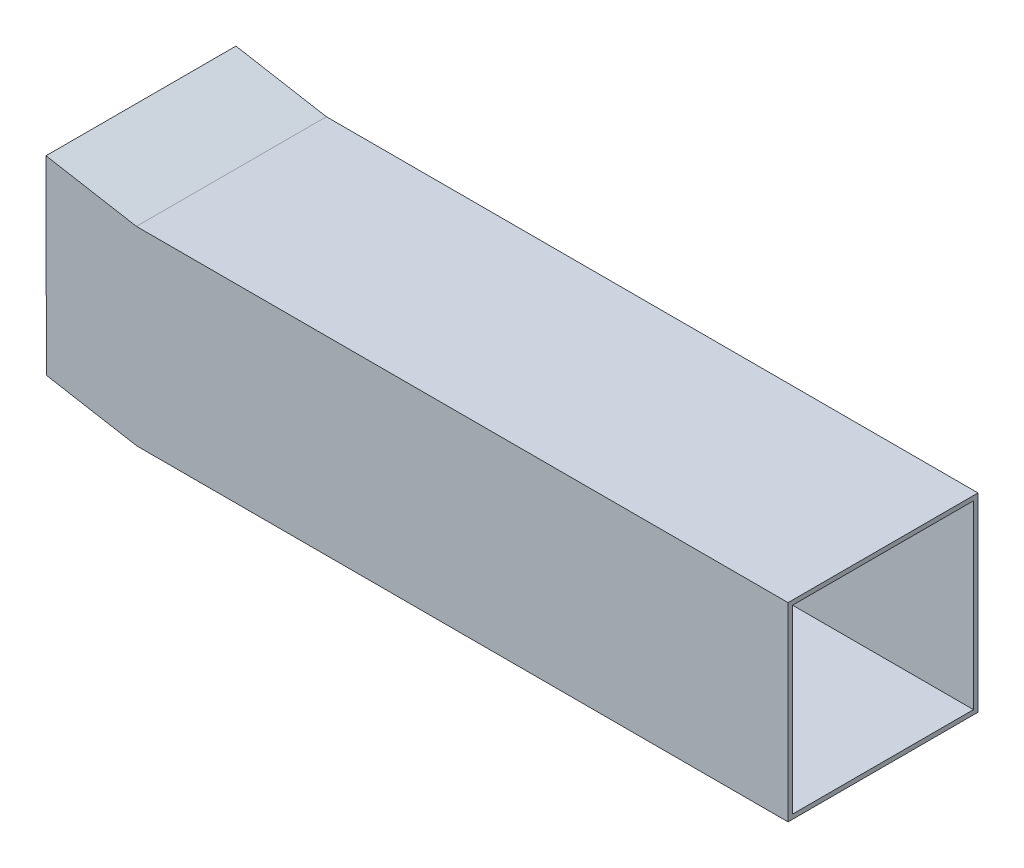
ISO-10303-21;
HEADER;
FILE_DESCRIPTION(('STEP AP214'),'2;1');
FILE_NAME('part.step','',(''),(''),'','','');
FILE_SCHEMA(('AUTOMOTIVE_DESIGN { 1 0 10303 214 1 1 1 1 }'));
ENDSEC;
DATA;
#1=APPLICATION_CONTEXT('core data for automotive mechanical design processes');
#2=APPLICATION_PROTOCOL_DEFINITION('international standard','automotive_design',2000,#1);
#3=PRODUCT_CONTEXT('',#1,'mechanical');
#4=PRODUCT('Part','Part','',(#3));
#5=PRODUCT_RELATED_PRODUCT_CATEGORY('part','',(#4));
#6=PRODUCT_DEFINITION_FORMATION('','',#4);
#7=PRODUCT_DEFINITION_CONTEXT('part definition',#1,'design');
#8=PRODUCT_DEFINITION('design','',#6,#7);
#9=PRODUCT_DEFINITION_SHAPE('','',#8);
#10=(LENGTH_UNIT() NAMED_UNIT(*) SI_UNIT(.MILLI.,.METRE.));
#11=(NAMED_UNIT(*) PLANE_ANGLE_UNIT() SI_UNIT($,.RADIAN.));
#12=(NAMED_UNIT(*) SI_UNIT($,.STERADIAN.) SOLID_ANGLE_UNIT());
#13=UNCERTAINTY_MEASURE_WITH_UNIT(LENGTH_MEASURE(1.E-05),#10,'distance_accuracy_value','');
#14=(GEOMETRIC_REPRESENTATION_CONTEXT(3) GLOBAL_UNCERTAINTY_ASSIGNED_CONTEXT((#13)) GLOBAL_UNIT_ASSIGNED_CONTEXT((#10,
#11,#12)) REPRESENTATION_CONTEXT('',''));
#15=CARTESIAN_POINT('',(0.,0.,0.));
#16=DIRECTION('',(0.,0.,1.));
#17=DIRECTION('',(1.,0.,0.));
#18=AXIS2_PLACEMENT_3D('',#15,#16,#17);
#19=CARTESIAN_POINT('',(-310.,1.63890065539904E-13,-126.));
#20=DIRECTION('',(-1.,0.,0.));
#21=DIRECTION('',(0.,-1.,0.));
#22=AXIS2_PLACEMENT_3D('',#19,#20,#21);
#23=PLANE('',#22);
#24=DIRECTION('',(0.,0.,1.));
#25=VECTOR('',#24,1.);
#26=CARTESIAN_POINT('',(-310.,-99.9228669405712,-126.));
#27=LINE('',#26,#25);
#28=CARTESIAN_POINT('',(-310.,-99.9228669405712,0.));
#29=VERTEX_POINT('',#28);
#30=CARTESIAN_POINT('',(-310.,-99.9228669405712,4.99999999999995));
#31=VERTEX_POINT('',#30);
#32=EDGE_CURVE('E377',#29,#31,#27,.T.);
#33=ORIENTED_EDGE('',*,*,#32,.T.);
#34=DIRECTION('',(0.,1.,0.));
#35=VECTOR('',#34,1.);
#36=CARTESIAN_POINT('',(-310.,1.63890065539904E-13,5.));
#37=LINE('',#36,#35);
#38=CARTESIAN_POINT('',(-310.,99.8220969025852,5.));
#39=VERTEX_POINT('',#38);
#40=EDGE_CURVE('E230',#31,#39,#37,.T.);
#41=ORIENTED_EDGE('',*,*,#40,.T.);
#42=DIRECTION('',(0.,0.,1.));
#43=VECTOR('',#42,1.);
#44=CARTESIAN_POINT('',(-310.,99.8220969025852,-126.));
#45=LINE('',#44,#43);
#46=CARTESIAN_POINT('',(-310.,99.8220969025852,0.));
#47=VERTEX_POINT('',#46);
#48=EDGE_CURVE('E372',#47,#39,#45,.T.);
#49=ORIENTED_EDGE('',*,*,#48,.F.);
#50=DIRECTION('',(0.,1.,0.));
#51=VECTOR('',#50,1.);
#52=CARTESIAN_POINT('',(-310.,1.63890065539904E-13,0.));
#53=LINE('',#52,#51);
#54=EDGE_CURVE('E404',#29,#47,#53,.T.);
#55=ORIENTED_EDGE('',*,*,#54,.F.);
#56=EDGE_LOOP('',(#33,#41,#49,#55));
#57=FACE_BOUND('',#56,.T.);
#58=ADVANCED_FACE('F65',(#57),#23,.T.);
#59=CARTESIAN_POINT('',(410.,-105.,210.));
#60=DIRECTION('',(-1.,0.,0.));
#61=DIRECTION('',(0.,0.,1.));
#62=AXIS2_PLACEMENT_3D('',#59,#60,#61);
#63=PLANE('',#62);
#64=DIRECTION('',(0.,0.,-1.));
#65=VECTOR('',#64,1.);
#66=CARTESIAN_POINT('',(410.,-105.,210.));
#67=LINE('',#66,#65);
#68=CARTESIAN_POINT('',(410.,-105.,210.));
#69=VERTEX_POINT('',#68);
#70=CARTESIAN_POINT('',(410.,-105.,0.));
#71=VERTEX_POINT('',#70);
#72=EDGE_CURVE('E391',#69,#71,#67,.T.);
#73=ORIENTED_EDGE('',*,*,#72,.T.);
#74=DIRECTION('',(0.,1.,0.));
#75=VECTOR('',#74,1.);
#76=CARTESIAN_POINT('',(410.,-105.,0.));
#77=LINE('',#76,#75);
#78=CARTESIAN_POINT('',(410.,105.,0.));
#79=VERTEX_POINT('',#78);
#80=EDGE_CURVE('E375',#71,#79,#77,.T.);
#81=ORIENTED_EDGE('',*,*,#80,.T.);
#82=DIRECTION('',(0.,0.,-1.));
#83=VECTOR('',#82,1.);
#84=CARTESIAN_POINT('',(410.,105.,210.));
#85=LINE('',#84,#83);
#86=CARTESIAN_POINT('',(410.,105.,210.));
#87=VERTEX_POINT('',#86);
#88=EDGE_CURVE('E399',#87,#79,#85,.T.);
#89=ORIENTED_EDGE('',*,*,#88,.F.);
#90=DIRECTION('',(0.,1.,0.));
#91=VECTOR('',#90,1.);
#92=CARTESIAN_POINT('',(410.,-105.,210.));
#93=LINE('',#92,#91);
#94=EDGE_CURVE('E382',#69,#87,#93,.T.);
#95=ORIENTED_EDGE('',*,*,#94,.F.);
#96=EDGE_LOOP('',(#73,#81,#89,#95));
#97=FACE_BOUND('',#96,.T.);
#98=DIRECTION('',(0.,0.,-1.));
#99=VECTOR('',#98,1.);
#100=CARTESIAN_POINT('',(410.,-100.,210.));
#101=LINE('',#100,#99);
#102=CARTESIAN_POINT('',(410.,-100.,205.));
#103=VERTEX_POINT('',#102);
#104=CARTESIAN_POINT('',(410.,-100.,5.));
#105=VERTEX_POINT('',#104);
#106=EDGE_CURVE('E245',#103,#105,#101,.T.);
#107=ORIENTED_EDGE('',*,*,#106,.F.);
#108=DIRECTION('',(0.,1.,0.));
#109=VECTOR('',#108,1.);
#110=CARTESIAN_POINT('',(410.,0.,205.));
#111=LINE('',#110,#109);
#112=CARTESIAN_POINT('',(410.,100.,205.));
#113=VERTEX_POINT('',#112);
#114=EDGE_CURVE('E246',#103,#113,#111,.T.);
#115=ORIENTED_EDGE('',*,*,#114,.T.);
#116=DIRECTION('',(0.,0.,-1.));
#117=VECTOR('',#116,1.);
#118=CARTESIAN_POINT('',(410.,100.,210.));
#119=LINE('',#118,#117);
#120=CARTESIAN_POINT('',(410.,100.,5.));
#121=VERTEX_POINT('',#120);
#122=EDGE_CURVE('E88',#113,#121,#119,.T.);
#123=ORIENTED_EDGE('',*,*,#122,.T.);
#124=DIRECTION('',(0.,1.,0.));
#125=VECTOR('',#124,1.);
#126=CARTESIAN_POINT('',(410.,0.,5.));
#127=LINE('',#126,#125);
#128=EDGE_CURVE('E241',#105,#121,#127,.T.);
#129=ORIENTED_EDGE('',*,*,#128,.F.);
#130=EDGE_LOOP('',(#107,#115,#123,#129));
#131=FACE_BOUND('',#130,.T.);
#132=ADVANCED_FACE('F67',(#97,#131),#63,.F.);
#133=CARTESIAN_POINT('',(-410.,-105.,210.));
#134=DIRECTION('',(1.,0.,0.));
#135=DIRECTION('',(0.,0.,-1.));
#136=AXIS2_PLACEMENT_3D('',#133,#134,#135);
#137=PLANE('',#136);
#138=DIRECTION('',(0.,1.,0.));
#139=VECTOR('',#138,1.);
#140=CARTESIAN_POINT('',(-410.,-105.,5.));
#141=LINE('',#140,#139);
#142=CARTESIAN_POINT('',(-410.,-87.3673019291542,5.));
#143=VERTEX_POINT('',#142);
#144=CARTESIAN_POINT('',(-410.,-82.3673019291542,4.99999999999995));
#145=VERTEX_POINT('',#144);
#146=EDGE_CURVE('E292',#143,#145,#141,.T.);
#147=ORIENTED_EDGE('',*,*,#146,.F.);
#148=DIRECTION('',(0.,0.,1.));
#149=VECTOR('',#148,1.);
#150=CARTESIAN_POINT('',(-410.,-87.3673019291542,-126.));
#151=LINE('',#150,#149);
#152=CARTESIAN_POINT('',(-410.,-87.3673019291542,205.));
#153=VERTEX_POINT('',#152);
#154=EDGE_CURVE('E370',#143,#153,#151,.T.);
#155=ORIENTED_EDGE('',*,*,#154,.T.);
#156=DIRECTION('',(0.,-1.,0.));
#157=VECTOR('',#156,1.);
#158=CARTESIAN_POINT('',(-410.,-105.,205.));
#159=LINE('',#158,#157);
#160=CARTESIAN_POINT('',(-410.,-82.3673019291542,205.));
#161=VERTEX_POINT('',#160);
#162=EDGE_CURVE('E328',#161,#153,#159,.T.);
#163=ORIENTED_EDGE('',*,*,#162,.F.);
#164=DIRECTION('',(0.,0.,1.));
#165=VECTOR('',#164,1.);
#166=CARTESIAN_POINT('',(-410.,-82.3673019291542,-126.));
#167=LINE('',#166,#165);
#168=EDGE_CURVE('E369',#145,#161,#167,.T.);
#169=ORIENTED_EDGE('',*,*,#168,.F.);
#170=EDGE_LOOP('',(#147,#155,#163,#169));
#171=FACE_BOUND('',#170,.T.);
#172=ADVANCED_FACE('F480',(#171),#137,.F.);
#173=CARTESIAN_POINT('',(-10.2658765721674,-117.339506153563,-126.));
#174=DIRECTION('',(-0.0871557427476605,-0.996194698091745,0.));
#175=DIRECTION('',(0.996194698091745,-0.0871557427476605,0.));
#176=AXIS2_PLACEMENT_3D('',#173,#174,#175);
#177=PLANE('',#176);
#178=DIRECTION('',(0.996194698091745,-0.0871557427476605,0.));
#179=VECTOR('',#178,1.);
#180=CARTESIAN_POINT('',(-10.2658765721674,-117.339506153563,5.));
#181=LINE('',#180,#179);
#182=CARTESIAN_POINT('',(-409.131759111665,-82.4432631640931,4.99999999999995));
#183=VERTEX_POINT('',#182);
#184=EDGE_CURVE('E287',#145,#183,#181,.T.);
#185=ORIENTED_EDGE('',*,*,#184,.F.);
#186=ORIENTED_EDGE('',*,*,#168,.T.);
#187=DIRECTION('',(-0.996194698091745,0.0871557427476605,0.));
#188=VECTOR('',#187,1.);
#189=CARTESIAN_POINT('',(-10.2658765721674,-117.339506153563,205.));
#190=LINE('',#189,#188);
#191=CARTESIAN_POINT('',(-409.131759111665,-82.4432631640931,205.));
#192=VERTEX_POINT('',#191);
#193=EDGE_CURVE('E325',#192,#161,#190,.T.);
#194=ORIENTED_EDGE('',*,*,#193,.F.);
#195=DIRECTION('',(0.,0.,1.));
#196=VECTOR('',#195,1.);
#197=CARTESIAN_POINT('',(-409.131759111665,-82.4432631640931,-126.));
#198=LINE('',#197,#196);
#199=EDGE_CURVE('E379',#183,#192,#198,.T.);
#200=ORIENTED_EDGE('',*,*,#199,.F.);
#201=EDGE_LOOP('',(#185,#186,#194,#200));
#202=FACE_BOUND('',#201,.T.);
#203=ADVANCED_FACE('F429',(#202),#177,.F.);
#204=CARTESIAN_POINT('',(-310.434120444167,0.,0.));
#205=DIRECTION('',(-1.,0.,0.));
#206=DIRECTION('',(0.,0.,1.));
#207=AXIS2_PLACEMENT_3D('',#204,#205,#206);
#208=PLANE('',#207);
#209=DIRECTION('',(0.,-1.,0.));
#210=VECTOR('',#209,1.);
#211=CARTESIAN_POINT('',(-310.434120444167,0.,5.));
#212=LINE('',#211,#210);
#213=CARTESIAN_POINT('',(-310.434120444167,99.949029068762,5.));
#214=VERTEX_POINT('',#213);
#215=CARTESIAN_POINT('',(-310.434120444167,99.4370594127237,5.));
#216=VERTEX_POINT('',#215);
#217=EDGE_CURVE('E282',#214,#216,#212,.T.);
#218=ORIENTED_EDGE('',*,*,#217,.F.);
#219=DIRECTION('',(0.,0.,1.));
#220=VECTOR('',#219,1.);
#221=CARTESIAN_POINT('',(-310.434120444167,99.949029068762,0.));
#222=LINE('',#221,#220);
#223=CARTESIAN_POINT('',(-310.434120444167,99.949029068762,205.));
#224=VERTEX_POINT('',#223);
#225=EDGE_CURVE('E354',#214,#224,#222,.T.);
#226=ORIENTED_EDGE('',*,*,#225,.T.);
#227=DIRECTION('',(0.,1.,0.));
#228=VECTOR('',#227,1.);
#229=CARTESIAN_POINT('',(-310.434120444167,0.,205.));
#230=LINE('',#229,#228);
#231=CARTESIAN_POINT('',(-310.434120444167,99.4370594127237,205.));
#232=VERTEX_POINT('',#231);
#233=EDGE_CURVE('E318',#232,#224,#230,.T.);
#234=ORIENTED_EDGE('',*,*,#233,.F.);
#235=DIRECTION('',(0.,0.,1.));
#236=VECTOR('',#235,1.);
#237=CARTESIAN_POINT('',(-310.434120444167,99.4370594127237,0.));
#238=LINE('',#237,#236);
#239=EDGE_CURVE('E356',#216,#232,#238,.T.);
#240=ORIENTED_EDGE('',*,*,#239,.F.);
#241=EDGE_LOOP('',(#218,#226,#234,#240));
#242=FACE_BOUND('',#241,.T.);
#243=ADVANCED_FACE('F442',(#242),#208,.F.);
#244=CARTESIAN_POINT('',(-61.5797786267126,-83.6843468577419,0.));
#245=DIRECTION('',(0.592685091482034,0.805434281822504,0.));
#246=DIRECTION('',(-0.805434281822504,0.592685091482034,0.));
#247=AXIS2_PLACEMENT_3D('',#244,#245,#246);
#248=PLANE('',#247);
#249=DIRECTION('',(-0.805434281822504,0.592685091482034,0.));
#250=VECTOR('',#249,1.);
#251=CARTESIAN_POINT('',(-61.5797786267126,-83.6843468577419,5.));
#252=LINE('',#251,#250);
#253=CARTESIAN_POINT('',(-311.302361332502,100.075961234939,5.));
#254=VERTEX_POINT('',#253);
#255=EDGE_CURVE('E280',#216,#254,#252,.T.);
#256=ORIENTED_EDGE('',*,*,#255,.F.);
#257=ORIENTED_EDGE('',*,*,#239,.T.);
#258=DIRECTION('',(0.805434281822504,-0.592685091482034,0.));
#259=VECTOR('',#258,1.);
#260=CARTESIAN_POINT('',(-61.5797786267126,-83.6843468577419,205.));
#261=LINE('',#260,#259);
#262=CARTESIAN_POINT('',(-311.302361332502,100.075961234939,205.));
#263=VERTEX_POINT('',#262);
#264=EDGE_CURVE('E315',#263,#232,#261,.T.);
#265=ORIENTED_EDGE('',*,*,#264,.F.);
#266=DIRECTION('',(0.,0.,1.));
#267=VECTOR('',#266,1.);
#268=CARTESIAN_POINT('',(-311.302361332502,100.075961234939,0.));
#269=LINE('',#268,#267);
#270=EDGE_CURVE('E358',#254,#263,#269,.T.);
#271=ORIENTED_EDGE('',*,*,#270,.F.);
#272=EDGE_LOOP('',(#256,#257,#265,#271));
#273=FACE_BOUND('',#272,.T.);
#274=ADVANCED_FACE('F448',(#273),#248,.F.);
#275=CARTESIAN_POINT('',(2.47311788189168,8.45830545323368,-126.));
#276=DIRECTION('',(-0.280639139888675,-0.959813353294558,0.));
#277=DIRECTION('',(0.959813353294558,-0.280639139888676,0.));
#278=AXIS2_PLACEMENT_3D('',#275,#276,#277);
#279=PLANE('',#278);
#280=DIRECTION('',(0.,0.,1.));
#281=VECTOR('',#280,1.);
#282=CARTESIAN_POINT('',(-310.423672558849,99.9459742190464,-126.));
#283=LINE('',#282,#281);
#284=CARTESIAN_POINT('',(-310.423672558849,99.9459742190464,0.));
#285=VERTEX_POINT('',#284);
#286=CARTESIAN_POINT('',(-310.423672558849,99.9459742190464,5.));
#287=VERTEX_POINT('',#286);
#288=EDGE_CURVE('E301',#285,#287,#283,.T.);
#289=ORIENTED_EDGE('',*,*,#288,.F.);
#290=DIRECTION('',(-0.959813353294558,0.280639139888676,0.));
#291=VECTOR('',#290,1.);
#292=CARTESIAN_POINT('',(2.47311788189168,8.45830545323368,0.));
#293=LINE('',#292,#291);
#294=EDGE_CURVE('E401',#47,#285,#293,.T.);
#295=ORIENTED_EDGE('',*,*,#294,.F.);
#296=ORIENTED_EDGE('',*,*,#48,.T.);
#297=CARTESIAN_POINT('',(-310.,99.8220969025852,205.));
#298=VERTEX_POINT('',#297);
#299=EDGE_CURVE('E376',#39,#298,#45,.T.);
#300=ORIENTED_EDGE('',*,*,#299,.T.);
#301=DIRECTION('',(-0.959813353294558,0.280639139888676,0.));
#302=VECTOR('',#301,1.);
#303=CARTESIAN_POINT('',(2.47311788189168,8.45830545323368,205.));
#304=LINE('',#303,#302);
#305=EDGE_CURVE('E321',#298,#224,#304,.T.);
#306=ORIENTED_EDGE('',*,*,#305,.T.);
#307=ORIENTED_EDGE('',*,*,#225,.F.);
#308=DIRECTION('',(0.959813353294558,-0.280639139888676,0.));
#309=VECTOR('',#308,1.);
#310=CARTESIAN_POINT('',(2.47311788189168,8.45830545323368,5.));
#311=LINE('',#310,#309);
#312=EDGE_CURVE('E284',#214,#287,#311,.T.);
#313=ORIENTED_EDGE('',*,*,#312,.T.);
#314=EDGE_LOOP('',(#289,#295,#296,#300,#306,#307,#313));
#315=FACE_BOUND('',#314,.T.);
#316=ADVANCED_FACE('F415',(#315),#279,.T.);
#317=CARTESIAN_POINT('',(-26.4354604144457,-149.922946041676,-126.));
#318=DIRECTION('',(0.173648177666923,0.984807753012209,0.));
#319=DIRECTION('',(-0.984807753012209,0.173648177666923,0.));
#320=AXIS2_PLACEMENT_3D('',#317,#318,#319);
#321=PLANE('',#320);
#322=DIRECTION('',(0.,0.,-1.));
#323=VECTOR('',#322,1.);
#324=CARTESIAN_POINT('',(-310.010499480782,-99.921015598826,-126.));
#325=LINE('',#324,#323);
#326=CARTESIAN_POINT('',(-310.010499480782,-99.921015598826,5.));
#327=VERTEX_POINT('',#326);
#328=CARTESIAN_POINT('',(-310.010499480782,-99.921015598826,0.));
#329=VERTEX_POINT('',#328);
#330=EDGE_CURVE('E298',#327,#329,#325,.T.);
#331=ORIENTED_EDGE('',*,*,#330,.F.);
#332=DIRECTION('',(-0.984807753012209,0.173648177666923,0.));
#333=VECTOR('',#332,1.);
#334=CARTESIAN_POINT('',(-26.4354604144457,-149.922946041676,5.));
#335=LINE('',#334,#333);
#336=EDGE_CURVE('E290',#327,#183,#335,.T.);
#337=ORIENTED_EDGE('',*,*,#336,.T.);
#338=ORIENTED_EDGE('',*,*,#199,.T.);
#339=DIRECTION('',(0.984807753012209,-0.173648177666923,0.));
#340=VECTOR('',#339,1.);
#341=CARTESIAN_POINT('',(-26.4354604144457,-149.922946041676,205.));
#342=LINE('',#341,#340);
#343=CARTESIAN_POINT('',(-309.56255668237,-100.,205.));
#344=VERTEX_POINT('',#343);
#345=EDGE_CURVE('E238',#192,#344,#342,.T.);
#346=ORIENTED_EDGE('',*,*,#345,.T.);
#347=DIRECTION('',(0.,0.,1.));
#348=VECTOR('',#347,1.);
#349=CARTESIAN_POINT('',(-309.56255668237,-100.,-126.));
#350=LINE('',#349,#348);
#351=CARTESIAN_POINT('',(-309.56255668237,-100.,5.));
#352=VERTEX_POINT('',#351);
#353=EDGE_CURVE('E235',#352,#344,#350,.T.);
#354=ORIENTED_EDGE('',*,*,#353,.F.);
#355=DIRECTION('',(0.984807753012209,-0.173648177666923,0.));
#356=VECTOR('',#355,1.);
#357=CARTESIAN_POINT('',(-26.4354604144457,-149.922946041676,5.));
#358=LINE('',#357,#356);
#359=EDGE_CURVE('E80',#31,#352,#358,.T.);
#360=ORIENTED_EDGE('',*,*,#359,.F.);
#361=ORIENTED_EDGE('',*,*,#32,.F.);
#362=DIRECTION('',(0.984807753012209,-0.173648177666923,0.));
#363=VECTOR('',#362,1.);
#364=CARTESIAN_POINT('',(-26.4354604144457,-149.922946041676,0.));
#365=LINE('',#364,#363);
#366=EDGE_CURVE('E73',#329,#29,#365,.T.);
#367=ORIENTED_EDGE('',*,*,#366,.F.);
#368=EDGE_LOOP('',(#331,#337,#338,#346,#354,#360,#361,#367));
#369=FACE_BOUND('',#368,.T.);
#370=ADVANCED_FACE('F236',(#369),#321,.T.);
#371=CARTESIAN_POINT('',(-410.,105.,210.));
#372=DIRECTION('',(0.,-1.,0.));
#373=DIRECTION('',(0.,0.,-1.));
#374=AXIS2_PLACEMENT_3D('',#371,#372,#373);
#375=PLANE('',#374);
#376=ORIENTED_EDGE('',*,*,#88,.T.);
#377=DIRECTION('',(-1.,0.,0.));
#378=VECTOR('',#377,1.);
#379=CARTESIAN_POINT('',(-410.,105.,0.));
#380=LINE('',#379,#378);
#381=CARTESIAN_POINT('',(-310.434120444167,105.,0.));
#382=VERTEX_POINT('',#381);
#383=EDGE_CURVE('E394',#79,#382,#380,.T.);
#384=ORIENTED_EDGE('',*,*,#383,.T.);
#385=DIRECTION('',(0.,0.,1.));
#386=VECTOR('',#385,1.);
#387=CARTESIAN_POINT('',(-310.434120444167,105.,0.));
#388=LINE('',#387,#386);
#389=CARTESIAN_POINT('',(-310.434120444167,105.,210.));
#390=VERTEX_POINT('',#389);
#391=EDGE_CURVE('E351',#382,#390,#388,.T.);
#392=ORIENTED_EDGE('',*,*,#391,.T.);
#393=DIRECTION('',(-1.,0.,0.));
#394=VECTOR('',#393,1.);
#395=CARTESIAN_POINT('',(-410.,105.,210.));
#396=LINE('',#395,#394);
#397=EDGE_CURVE('E385',#87,#390,#396,.T.);
#398=ORIENTED_EDGE('',*,*,#397,.F.);
#399=EDGE_LOOP('',(#376,#384,#392,#398));
#400=FACE_BOUND('',#399,.T.);
#401=ADVANCED_FACE('F498',(#400),#375,.F.);
#402=CARTESIAN_POINT('',(-410.,-105.,210.));
#403=DIRECTION('',(0.,1.,0.));
#404=DIRECTION('',(0.,0.,1.));
#405=AXIS2_PLACEMENT_3D('',#402,#403,#404);
#406=PLANE('',#405);
#407=DIRECTION('',(1.,0.,0.));
#408=VECTOR('',#407,1.);
#409=CARTESIAN_POINT('',(-410.,-105.,210.));
#410=LINE('',#409,#408);
#411=CARTESIAN_POINT('',(-310.,-105.,210.));
#412=VERTEX_POINT('',#411);
#413=EDGE_CURVE('E389',#412,#69,#410,.T.);
#414=ORIENTED_EDGE('',*,*,#413,.F.);
#415=DIRECTION('',(0.,0.,1.));
#416=VECTOR('',#415,1.);
#417=CARTESIAN_POINT('',(-310.,-105.,-126.));
#418=LINE('',#417,#416);
#419=CARTESIAN_POINT('',(-310.,-105.,0.));
#420=VERTEX_POINT('',#419);
#421=EDGE_CURVE('E365',#420,#412,#418,.T.);
#422=ORIENTED_EDGE('',*,*,#421,.F.);
#423=DIRECTION('',(1.,0.,0.));
#424=VECTOR('',#423,1.);
#425=CARTESIAN_POINT('',(-410.,-105.,0.));
#426=LINE('',#425,#424);
#427=EDGE_CURVE('E386',#420,#71,#426,.T.);
#428=ORIENTED_EDGE('',*,*,#427,.T.);
#429=ORIENTED_EDGE('',*,*,#72,.F.);
#430=EDGE_LOOP('',(#414,#422,#428,#429));
#431=FACE_BOUND('',#430,.T.);
#432=ADVANCED_FACE('F470',(#431),#406,.F.);
#433=CARTESIAN_POINT('',(0.,0.,210.));
#434=DIRECTION('',(0.,0.,-1.));
#435=DIRECTION('',(-1.,0.,0.));
#436=AXIS2_PLACEMENT_3D('',#433,#434,#435);
#437=PLANE('',#436);
#438=DIRECTION('',(0.00206723579317681,-0.999997863265805,0.));
#439=VECTOR('',#438,1.);
#440=CARTESIAN_POINT('',(-410.434120444167,122.632698070847,210.));
#441=LINE('',#440,#439);
#442=CARTESIAN_POINT('',(-410.423620963385,117.553713669673,210.));
#443=VERTEX_POINT('',#442);
#444=CARTESIAN_POINT('',(-410.,-87.3673019291542,210.));
#445=VERTEX_POINT('',#444);
#446=EDGE_CURVE('E303',#443,#445,#441,.T.);
#447=ORIENTED_EDGE('',*,*,#446,.T.);
#448=DIRECTION('',(-0.984807753012209,0.173648177666923,0.));
#449=VECTOR('',#448,1.);
#450=CARTESIAN_POINT('',(-27.3037013027804,-154.846984806737,210.));
#451=LINE('',#450,#449);
#452=EDGE_CURVE('E353',#412,#445,#451,.T.);
#453=ORIENTED_EDGE('',*,*,#452,.F.);
#454=ORIENTED_EDGE('',*,*,#413,.T.);
#455=ORIENTED_EDGE('',*,*,#94,.T.);
#456=ORIENTED_EDGE('',*,*,#397,.T.);
#457=DIRECTION('',(-0.984807753012208,0.173648177666931,0.));
#458=VECTOR('',#457,1.);
#459=CARTESIAN_POINT('',(8.59532341328792,48.7465014075141,210.));
#460=LINE('',#459,#458);
#461=CARTESIAN_POINT('',(-410.434120444167,122.632698070847,210.));
#462=VERTEX_POINT('',#461);
#463=EDGE_CURVE('E334',#390,#462,#460,.T.);
#464=ORIENTED_EDGE('',*,*,#463,.T.);
#465=DIRECTION('',(0.,-1.,0.));
#466=VECTOR('',#465,1.);
#467=CARTESIAN_POINT('',(-410.434120444167,0.,210.));
#468=LINE('',#467,#466);
#469=CARTESIAN_POINT('',(-410.434120444167,117.555565011418,210.));
#470=VERTEX_POINT('',#469);
#471=EDGE_CURVE('E347',#462,#470,#468,.T.);
#472=ORIENTED_EDGE('',*,*,#471,.T.);
#473=DIRECTION('',(-0.984807753012208,0.173648177666931,0.));
#474=VECTOR('',#473,1.);
#475=CARTESIAN_POINT('',(7.72708252495327,43.8224626424531,210.));
#476=LINE('',#475,#474);
#477=EDGE_CURVE('E339',#443,#470,#476,.T.);
#478=ORIENTED_EDGE('',*,*,#477,.F.);
#479=EDGE_LOOP('',(#447,#453,#454,#455,#456,#464,#472,#478));
#480=FACE_BOUND('',#479,.T.);
#481=ADVANCED_FACE('F474',(#480),#437,.F.);
#482=CARTESIAN_POINT('',(0.,0.,0.));
#483=DIRECTION('',(0.,0.,-1.));
#484=DIRECTION('',(-1.,0.,0.));
#485=AXIS2_PLACEMENT_3D('',#482,#483,#484);
#486=PLANE('',#485);
#487=ORIENTED_EDGE('',*,*,#294,.T.);
#488=DIRECTION('',(0.00206723579317735,-0.999997863265805,0.));
#489=VECTOR('',#488,1.);
#490=CARTESIAN_POINT('',(-310.434120444167,105.,0.));
#491=LINE('',#490,#489);
#492=EDGE_CURVE('E267',#285,#329,#491,.T.);
#493=ORIENTED_EDGE('',*,*,#492,.T.);
#494=ORIENTED_EDGE('',*,*,#366,.T.);
#495=ORIENTED_EDGE('',*,*,#54,.T.);
#496=EDGE_LOOP('',(#487,#493,#494,#495));
#497=FACE_BOUND('',#496,.T.);
#498=DIRECTION('',(0.984807753012209,-0.173648177666923,0.));
#499=VECTOR('',#498,1.);
#500=CARTESIAN_POINT('',(-27.3037013027804,-154.846984806737,0.));
#501=LINE('',#500,#499);
#502=CARTESIAN_POINT('',(-410.,-87.3673019291542,0.));
#503=VERTEX_POINT('',#502);
#504=EDGE_CURVE('E12',#503,#420,#501,.T.);
#505=ORIENTED_EDGE('',*,*,#504,.F.);
#506=DIRECTION('',(-0.00206723579317681,0.999997863265805,0.));
#507=VECTOR('',#506,1.);
#508=CARTESIAN_POINT('',(-410.,-87.3673019291542,0.));
#509=LINE('',#508,#507);
#510=CARTESIAN_POINT('',(-410.423620963385,117.553713669673,0.));
#511=VERTEX_POINT('',#510);
#512=EDGE_CURVE('E272',#503,#511,#509,.T.);
#513=ORIENTED_EDGE('',*,*,#512,.T.);
#514=DIRECTION('',(-0.984807753012208,0.173648177666931,0.));
#515=VECTOR('',#514,1.);
#516=CARTESIAN_POINT('',(7.72708252495327,43.8224626424531,0.));
#517=LINE('',#516,#515);
#518=CARTESIAN_POINT('',(-410.434120444167,117.555565011418,0.));
#519=VERTEX_POINT('',#518);
#520=EDGE_CURVE('E342',#511,#519,#517,.T.);
#521=ORIENTED_EDGE('',*,*,#520,.T.);
#522=DIRECTION('',(0.,-1.,0.));
#523=VECTOR('',#522,1.);
#524=CARTESIAN_POINT('',(-410.434120444167,0.,0.));
#525=LINE('',#524,#523);
#526=CARTESIAN_POINT('',(-410.434120444167,122.632698070847,0.));
#527=VERTEX_POINT('',#526);
#528=EDGE_CURVE('E338',#527,#519,#525,.T.);
#529=ORIENTED_EDGE('',*,*,#528,.F.);
#530=DIRECTION('',(-0.984807753012208,0.173648177666931,0.));
#531=VECTOR('',#530,1.);
#532=CARTESIAN_POINT('',(8.59532341328792,48.7465014075141,0.));
#533=LINE('',#532,#531);
#534=EDGE_CURVE('E335',#382,#527,#533,.T.);
#535=ORIENTED_EDGE('',*,*,#534,.F.);
#536=ORIENTED_EDGE('',*,*,#383,.F.);
#537=ORIENTED_EDGE('',*,*,#80,.F.);
#538=ORIENTED_EDGE('',*,*,#427,.F.);
#539=EDGE_LOOP('',(#505,#513,#521,#529,#535,#536,#537,#538));
#540=FACE_BOUND('',#539,.T.);
#541=ADVANCED_FACE('F408',(#497,#540),#486,.T.);
#542=CARTESIAN_POINT('',(-27.3037013027804,-154.846984806737,-126.));
#543=DIRECTION('',(0.173648177666923,0.984807753012209,0.));
#544=DIRECTION('',(-0.984807753012209,0.173648177666923,0.));
#545=AXIS2_PLACEMENT_3D('',#542,#543,#544);
#546=PLANE('',#545);
#547=ORIENTED_EDGE('',*,*,#421,.T.);
#548=ORIENTED_EDGE('',*,*,#452,.T.);
#549=DIRECTION('',(0.,0.,1.));
#550=VECTOR('',#549,1.);
#551=CARTESIAN_POINT('',(-410.,-87.3673019291542,205.));
#552=LINE('',#551,#550);
#553=EDGE_CURVE('E307',#153,#445,#552,.T.);
#554=ORIENTED_EDGE('',*,*,#553,.F.);
#555=ORIENTED_EDGE('',*,*,#154,.F.);
#556=EDGE_CURVE('E366',#503,#143,#151,.T.);
#557=ORIENTED_EDGE('',*,*,#556,.F.);
#558=ORIENTED_EDGE('',*,*,#504,.T.);
#559=EDGE_LOOP('',(#547,#548,#554,#555,#557,#558));
#560=FACE_BOUND('',#559,.T.);
#561=ADVANCED_FACE('F460',(#560),#546,.F.);
#562=CARTESIAN_POINT('',(8.59532341328792,48.7465014075141,0.));
#563=DIRECTION('',(0.173648177666931,0.984807753012208,0.));
#564=DIRECTION('',(-0.984807753012208,0.173648177666931,0.));
#565=AXIS2_PLACEMENT_3D('',#562,#563,#564);
#566=PLANE('',#565);
#567=DIRECTION('',(0.,0.,1.));
#568=VECTOR('',#567,1.);
#569=CARTESIAN_POINT('',(-410.434120444167,122.632698070847,0.));
#570=LINE('',#569,#568);
#571=EDGE_CURVE('E344',#527,#462,#570,.T.);
#572=ORIENTED_EDGE('',*,*,#571,.T.);
#573=ORIENTED_EDGE('',*,*,#463,.F.);
#574=ORIENTED_EDGE('',*,*,#391,.F.);
#575=ORIENTED_EDGE('',*,*,#534,.T.);
#576=EDGE_LOOP('',(#572,#573,#574,#575));
#577=FACE_BOUND('',#576,.T.);
#578=ADVANCED_FACE('F518',(#577),#566,.T.);
#579=CARTESIAN_POINT('',(7.72708252495327,43.8224626424531,0.));
#580=DIRECTION('',(0.173648177666931,0.984807753012208,0.));
#581=DIRECTION('',(-0.984807753012208,0.173648177666931,0.));
#582=AXIS2_PLACEMENT_3D('',#579,#580,#581);
#583=PLANE('',#582);
#584=ORIENTED_EDGE('',*,*,#520,.F.);
#585=DIRECTION('',(0.,0.,1.));
#586=VECTOR('',#585,1.);
#587=CARTESIAN_POINT('',(-410.423620963385,117.553713669673,0.));
#588=LINE('',#587,#586);
#589=CARTESIAN_POINT('',(-410.423620963385,117.553713669673,5.));
#590=VERTEX_POINT('',#589);
#591=EDGE_CURVE('E295',#511,#590,#588,.T.);
#592=ORIENTED_EDGE('',*,*,#591,.T.);
#593=DIRECTION('',(-0.984807753012208,0.173648177666931,0.));
#594=VECTOR('',#593,1.);
#595=CARTESIAN_POINT('',(7.72708252495327,43.8224626424531,5.));
#596=LINE('',#595,#594);
#597=EDGE_CURVE('E275',#254,#590,#596,.T.);
#598=ORIENTED_EDGE('',*,*,#597,.F.);
#599=ORIENTED_EDGE('',*,*,#270,.T.);
#600=DIRECTION('',(0.984807753012208,-0.173648177666931,0.));
#601=VECTOR('',#600,1.);
#602=CARTESIAN_POINT('',(7.72708252495327,43.8224626424531,205.));
#603=LINE('',#602,#601);
#604=CARTESIAN_POINT('',(-410.423620963385,117.553713669673,205.));
#605=VERTEX_POINT('',#604);
#606=EDGE_CURVE('E312',#605,#263,#603,.T.);
#607=ORIENTED_EDGE('',*,*,#606,.F.);
#608=DIRECTION('',(0.,0.,1.));
#609=VECTOR('',#608,1.);
#610=CARTESIAN_POINT('',(-410.423620963385,117.553713669673,0.));
#611=LINE('',#610,#609);
#612=EDGE_CURVE('E331',#605,#443,#611,.T.);
#613=ORIENTED_EDGE('',*,*,#612,.T.);
#614=ORIENTED_EDGE('',*,*,#477,.T.);
#615=DIRECTION('',(0.,0.,1.));
#616=VECTOR('',#615,1.);
#617=CARTESIAN_POINT('',(-410.434120444167,117.555565011418,0.));
#618=LINE('',#617,#616);
#619=EDGE_CURVE('E360',#519,#470,#618,.T.);
#620=ORIENTED_EDGE('',*,*,#619,.F.);
#621=EDGE_LOOP('',(#584,#592,#598,#599,#607,#613,#614,#620));
#622=FACE_BOUND('',#621,.T.);
#623=ADVANCED_FACE('F452',(#622),#583,.F.);
#624=CARTESIAN_POINT('',(-410.434120444167,0.,0.));
#625=DIRECTION('',(-1.,0.,0.));
#626=DIRECTION('',(0.,0.,1.));
#627=AXIS2_PLACEMENT_3D('',#624,#625,#626);
#628=PLANE('',#627);
#629=ORIENTED_EDGE('',*,*,#471,.F.);
#630=ORIENTED_EDGE('',*,*,#571,.F.);
#631=ORIENTED_EDGE('',*,*,#528,.T.);
#632=ORIENTED_EDGE('',*,*,#619,.T.);
#633=EDGE_LOOP('',(#629,#630,#631,#632));
#634=FACE_BOUND('',#633,.T.);
#635=ADVANCED_FACE('F521',(#634),#628,.T.);
#636=CARTESIAN_POINT('',(-410.434120444167,122.632698070847,205.));
#637=DIRECTION('',(-0.999997863265805,-0.00206723579317681,0.));
#638=DIRECTION('',(0.00206723579317681,-0.999997863265805,0.));
#639=AXIS2_PLACEMENT_3D('',#636,#637,#638);
#640=PLANE('',#639);
#641=ORIENTED_EDGE('',*,*,#612,.F.);
#642=DIRECTION('',(0.00206723579317681,-0.999997863265805,0.));
#643=VECTOR('',#642,1.);
#644=CARTESIAN_POINT('',(-410.434120444167,122.632698070847,205.));
#645=LINE('',#644,#643);
#646=EDGE_CURVE('E304',#605,#153,#645,.T.);
#647=ORIENTED_EDGE('',*,*,#646,.T.);
#648=ORIENTED_EDGE('',*,*,#553,.T.);
#649=ORIENTED_EDGE('',*,*,#446,.F.);
#650=EDGE_LOOP('',(#641,#647,#648,#649));
#651=FACE_BOUND('',#650,.T.);
#652=ADVANCED_FACE('F477',(#651),#640,.T.);
#653=CARTESIAN_POINT('',(0.,0.,205.));
#654=DIRECTION('',(0.,0.,1.));
#655=DIRECTION('',(1.,0.,0.));
#656=AXIS2_PLACEMENT_3D('',#653,#654,#655);
#657=PLANE('',#656);
#658=ORIENTED_EDGE('',*,*,#193,.T.);
#659=ORIENTED_EDGE('',*,*,#162,.T.);
#660=ORIENTED_EDGE('',*,*,#646,.F.);
#661=ORIENTED_EDGE('',*,*,#606,.T.);
#662=ORIENTED_EDGE('',*,*,#264,.T.);
#663=ORIENTED_EDGE('',*,*,#233,.T.);
#664=ORIENTED_EDGE('',*,*,#305,.F.);
#665=DIRECTION('',(0.,-1.,0.));
#666=VECTOR('',#665,1.);
#667=CARTESIAN_POINT('',(-310.,1.63890065539904E-13,205.));
#668=LINE('',#667,#666);
#669=CARTESIAN_POINT('',(-310.,100.,205.));
#670=VERTEX_POINT('',#669);
#671=EDGE_CURVE('E265',#670,#298,#668,.T.);
#672=ORIENTED_EDGE('',*,*,#671,.F.);
#673=DIRECTION('',(-1.,0.,0.));
#674=VECTOR('',#673,1.);
#675=CARTESIAN_POINT('',(0.,100.,205.));
#676=LINE('',#675,#674);
#677=EDGE_CURVE('E250',#113,#670,#676,.T.);
#678=ORIENTED_EDGE('',*,*,#677,.F.);
#679=ORIENTED_EDGE('',*,*,#114,.F.);
#680=DIRECTION('',(1.,0.,0.));
#681=VECTOR('',#680,1.);
#682=CARTESIAN_POINT('',(0.,-100.,205.));
#683=LINE('',#682,#681);
#684=EDGE_CURVE('E255',#344,#103,#683,.T.);
#685=ORIENTED_EDGE('',*,*,#684,.F.);
#686=ORIENTED_EDGE('',*,*,#345,.F.);
#687=EDGE_LOOP('',(#658,#659,#660,#661,#662,#663,#664,#672,#678,#679,#685,#686));
#688=FACE_BOUND('',#687,.T.);
#689=ADVANCED_FACE('F433',(#688),#657,.F.);
#690=CARTESIAN_POINT('',(-410.,-87.3673019291542,5.));
#691=DIRECTION('',(-0.999997863265805,-0.00206723579317681,0.));
#692=DIRECTION('',(0.00206723579317681,-0.999997863265805,0.));
#693=AXIS2_PLACEMENT_3D('',#690,#691,#692);
#694=PLANE('',#693);
#695=ORIENTED_EDGE('',*,*,#591,.F.);
#696=ORIENTED_EDGE('',*,*,#512,.F.);
#697=ORIENTED_EDGE('',*,*,#556,.T.);
#698=DIRECTION('',(-0.00206723579317681,0.999997863265805,0.));
#699=VECTOR('',#698,1.);
#700=CARTESIAN_POINT('',(-410.,-87.3673019291542,5.));
#701=LINE('',#700,#699);
#702=EDGE_CURVE('E271',#143,#590,#701,.T.);
#703=ORIENTED_EDGE('',*,*,#702,.T.);
#704=EDGE_LOOP('',(#695,#696,#697,#703));
#705=FACE_BOUND('',#704,.T.);
#706=ADVANCED_FACE('F456',(#705),#694,.T.);
#707=CARTESIAN_POINT('',(0.,0.,5.));
#708=DIRECTION('',(0.,0.,-1.));
#709=DIRECTION('',(-1.,0.,0.));
#710=AXIS2_PLACEMENT_3D('',#707,#708,#709);
#711=PLANE('',#710);
#712=ORIENTED_EDGE('',*,*,#702,.F.);
#713=ORIENTED_EDGE('',*,*,#146,.T.);
#714=ORIENTED_EDGE('',*,*,#184,.T.);
#715=ORIENTED_EDGE('',*,*,#336,.F.);
#716=DIRECTION('',(0.00206723579317735,-0.999997863265805,0.));
#717=VECTOR('',#716,1.);
#718=CARTESIAN_POINT('',(-310.434120444167,105.,5.));
#719=LINE('',#718,#717);
#720=EDGE_CURVE('E268',#287,#327,#719,.T.);
#721=ORIENTED_EDGE('',*,*,#720,.F.);
#722=ORIENTED_EDGE('',*,*,#312,.F.);
#723=ORIENTED_EDGE('',*,*,#217,.T.);
#724=ORIENTED_EDGE('',*,*,#255,.T.);
#725=ORIENTED_EDGE('',*,*,#597,.T.);
#726=EDGE_LOOP('',(#712,#713,#714,#715,#721,#722,#723,#724,#725));
#727=FACE_BOUND('',#726,.T.);
#728=ADVANCED_FACE('F424',(#727),#711,.F.);
#729=CARTESIAN_POINT('',(-310.434120444167,105.,5.));
#730=DIRECTION('',(0.999997863265805,0.00206723579317735,0.));
#731=DIRECTION('',(-0.00206723579317735,0.999997863265805,0.));
#732=AXIS2_PLACEMENT_3D('',#729,#730,#731);
#733=PLANE('',#732);
#734=ORIENTED_EDGE('',*,*,#492,.F.);
#735=ORIENTED_EDGE('',*,*,#288,.T.);
#736=ORIENTED_EDGE('',*,*,#720,.T.);
#737=ORIENTED_EDGE('',*,*,#330,.T.);
#738=EDGE_LOOP('',(#734,#735,#736,#737));
#739=FACE_BOUND('',#738,.T.);
#740=ADVANCED_FACE('F420',(#739),#733,.T.);
#741=CARTESIAN_POINT('',(-310.,1.63890065539904E-13,-126.));
#742=DIRECTION('',(-1.,0.,0.));
#743=DIRECTION('',(0.,-1.,0.));
#744=AXIS2_PLACEMENT_3D('',#741,#742,#743);
#745=PLANE('',#744);
#746=CARTESIAN_POINT('',(-310.,100.,5.));
#747=VERTEX_POINT('',#746);
#748=EDGE_CURVE('E259',#39,#747,#37,.T.);
#749=ORIENTED_EDGE('',*,*,#748,.T.);
#750=DIRECTION('',(0.,0.,-1.));
#751=VECTOR('',#750,1.);
#752=CARTESIAN_POINT('',(-310.,100.,210.));
#753=LINE('',#752,#751);
#754=EDGE_CURVE('E232',#670,#747,#753,.T.);
#755=ORIENTED_EDGE('',*,*,#754,.F.);
#756=ORIENTED_EDGE('',*,*,#671,.T.);
#757=ORIENTED_EDGE('',*,*,#299,.F.);
#758=EDGE_LOOP('',(#749,#755,#756,#757));
#759=FACE_BOUND('',#758,.T.);
#760=ADVANCED_FACE('F439',(#759),#745,.F.);
#761=CARTESIAN_POINT('',(-410.,100.,210.));
#762=DIRECTION('',(0.,-1.,0.));
#763=DIRECTION('',(0.,0.,-1.));
#764=AXIS2_PLACEMENT_3D('',#761,#762,#763);
#765=PLANE('',#764);
#766=ORIENTED_EDGE('',*,*,#754,.T.);
#767=DIRECTION('',(-1.,0.,0.));
#768=VECTOR('',#767,1.);
#769=CARTESIAN_POINT('',(0.,100.,5.));
#770=LINE('',#769,#768);
#771=EDGE_CURVE('E247',#121,#747,#770,.T.);
#772=ORIENTED_EDGE('',*,*,#771,.F.);
#773=ORIENTED_EDGE('',*,*,#122,.F.);
#774=ORIENTED_EDGE('',*,*,#677,.T.);
#775=EDGE_LOOP('',(#766,#772,#773,#774));
#776=FACE_BOUND('',#775,.T.);
#777=ADVANCED_FACE('F436',(#776),#765,.T.);
#778=CARTESIAN_POINT('',(-410.,-100.,210.));
#779=DIRECTION('',(0.,1.,0.));
#780=DIRECTION('',(0.,0.,1.));
#781=AXIS2_PLACEMENT_3D('',#778,#779,#780);
#782=PLANE('',#781);
#783=ORIENTED_EDGE('',*,*,#684,.T.);
#784=ORIENTED_EDGE('',*,*,#106,.T.);
#785=DIRECTION('',(1.,0.,0.));
#786=VECTOR('',#785,1.);
#787=CARTESIAN_POINT('',(0.,-100.,5.));
#788=LINE('',#787,#786);
#789=EDGE_CURVE('E226',#352,#105,#788,.T.);
#790=ORIENTED_EDGE('',*,*,#789,.F.);
#791=ORIENTED_EDGE('',*,*,#353,.T.);
#792=EDGE_LOOP('',(#783,#784,#790,#791));
#793=FACE_BOUND('',#792,.T.);
#794=ADVANCED_FACE('F243',(#793),#782,.T.);
#795=CARTESIAN_POINT('',(0.,0.,5.));
#796=DIRECTION('',(0.,0.,-1.));
#797=DIRECTION('',(-1.,0.,0.));
#798=AXIS2_PLACEMENT_3D('',#795,#796,#797);
#799=PLANE('',#798);
#800=ORIENTED_EDGE('',*,*,#359,.T.);
#801=ORIENTED_EDGE('',*,*,#789,.T.);
#802=ORIENTED_EDGE('',*,*,#128,.T.);
#803=ORIENTED_EDGE('',*,*,#771,.T.);
#804=ORIENTED_EDGE('',*,*,#748,.F.);
#805=ORIENTED_EDGE('',*,*,#40,.F.);
#806=EDGE_LOOP('',(#800,#801,#802,#803,#804,#805));
#807=FACE_BOUND('',#806,.T.);
#808=ADVANCED_FACE('F223',(#807),#799,.F.);
#809=CLOSED_SHELL('',(#58,#132,#172,#203,#243,#274,#316,#370,#401,#432,#481,#541,#561,#578,#623,
#635,#652,#689,#706,#728,#740,#760,#777,#794,#808));
#810=MANIFOLD_SOLID_BREP('B2',#809);
#811=ADVANCED_BREP_SHAPE_REPRESENTATION('',(#18,#810),#14);
#812=SHAPE_DEFINITION_REPRESENTATION(#9,#811);
ENDSEC;
END-ISO-10303-21;
